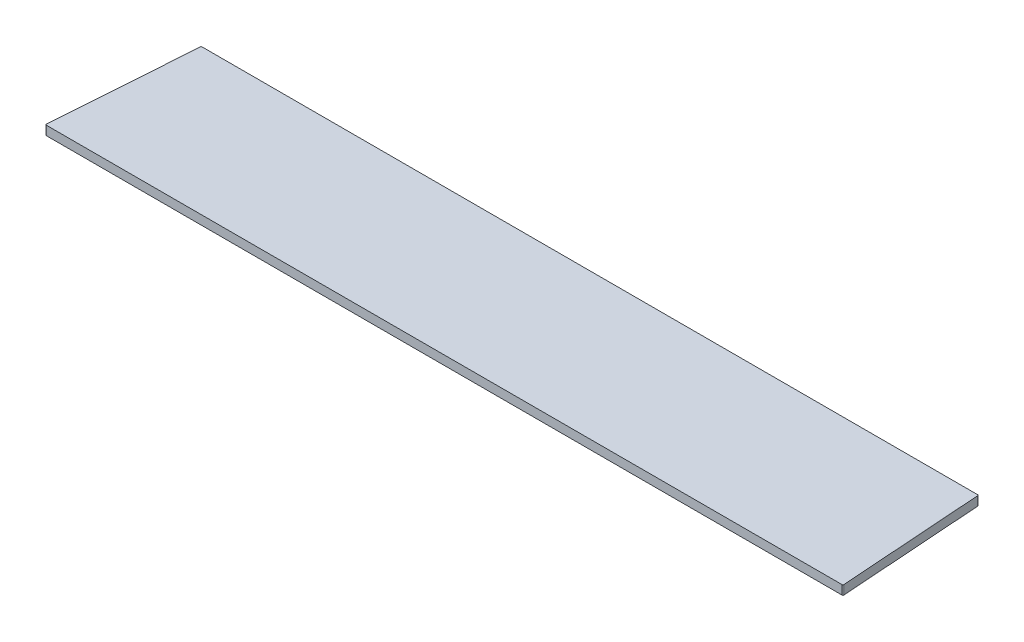
ISO-10303-21;
HEADER;
FILE_DESCRIPTION(('STEP AP214'),'2;1');
FILE_NAME('part.step','',(''),(''),'','','');
FILE_SCHEMA(('AUTOMOTIVE_DESIGN { 1 0 10303 214 1 1 1 1 }'));
ENDSEC;
DATA;
#1=APPLICATION_CONTEXT('core data for automotive mechanical design processes');
#2=APPLICATION_PROTOCOL_DEFINITION('international standard','automotive_design',2000,#1);
#3=PRODUCT_CONTEXT('',#1,'mechanical');
#4=PRODUCT('Part','Part','',(#3));
#5=PRODUCT_RELATED_PRODUCT_CATEGORY('part','',(#4));
#6=PRODUCT_DEFINITION_FORMATION('','',#4);
#7=PRODUCT_DEFINITION_CONTEXT('part definition',#1,'design');
#8=PRODUCT_DEFINITION('design','',#6,#7);
#9=PRODUCT_DEFINITION_SHAPE('','',#8);
#10=(LENGTH_UNIT() NAMED_UNIT(*) SI_UNIT(.MILLI.,.METRE.));
#11=(NAMED_UNIT(*) PLANE_ANGLE_UNIT() SI_UNIT($,.RADIAN.));
#12=(NAMED_UNIT(*) SI_UNIT($,.STERADIAN.) SOLID_ANGLE_UNIT());
#13=UNCERTAINTY_MEASURE_WITH_UNIT(LENGTH_MEASURE(1.E-05),#10,'distance_accuracy_value','');
#14=(GEOMETRIC_REPRESENTATION_CONTEXT(3) GLOBAL_UNCERTAINTY_ASSIGNED_CONTEXT((#13)) GLOBAL_UNIT_ASSIGNED_CONTEXT((#10,
#11,#12)) REPRESENTATION_CONTEXT('',''));
#15=CARTESIAN_POINT('',(0.,0.,0.));
#16=DIRECTION('',(0.,0.,1.));
#17=DIRECTION('',(1.,0.,0.));
#18=AXIS2_PLACEMENT_3D('',#15,#16,#17);
#19=CARTESIAN_POINT('',(-426.811710089038,-10.,-160.));
#20=DIRECTION('',(-0.997564050259824,0.,-0.069756473744129));
#21=DIRECTION('',(-0.069756473744129,0.,0.997564050259824));
#22=AXIS2_PLACEMENT_3D('',#19,#20,#21);
#23=PLANE('',#22);
#24=DIRECTION('',(-0.069756473744129,0.,0.997564050259824));
#25=VECTOR('',#24,1.);
#26=CARTESIAN_POINT('',(-426.811710089038,0.,-160.));
#27=LINE('',#26,#25);
#28=CARTESIAN_POINT('',(-426.87675905316,0.,-159.069756473744));
#29=VERTEX_POINT('',#28);
#30=CARTESIAN_POINT('',(-437.925195340235,0.,-1.0697564737441));
#31=VERTEX_POINT('',#30);
#32=EDGE_CURVE('E108',#29,#31,#27,.T.);
#33=ORIENTED_EDGE('',*,*,#32,.F.);
#34=DIRECTION('',(0.,1.,0.));
#35=VECTOR('',#34,1.);
#36=CARTESIAN_POINT('',(-426.87675905316,-10.,-159.069756473744));
#37=LINE('',#36,#35);
#38=CARTESIAN_POINT('',(-426.87675905316,-10.,-159.069756473744));
#39=VERTEX_POINT('',#38);
#40=EDGE_CURVE('E11',#29,#39,#37,.F.);
#41=ORIENTED_EDGE('',*,*,#40,.T.);
#42=DIRECTION('',(-0.069756473744129,0.,0.997564050259824));
#43=VECTOR('',#42,1.);
#44=CARTESIAN_POINT('',(-426.811710089038,-10.,-160.));
#45=LINE('',#44,#43);
#46=CARTESIAN_POINT('',(-437.925195340235,-10.,-1.0697564737441));
#47=VERTEX_POINT('',#46);
#48=EDGE_CURVE('E158',#39,#47,#45,.T.);
#49=ORIENTED_EDGE('',*,*,#48,.T.);
#50=DIRECTION('',(0.,1.,0.));
#51=VECTOR('',#50,1.);
#52=CARTESIAN_POINT('',(-437.925195340235,-10.,-1.06975647374413));
#53=LINE('',#52,#51);
#54=EDGE_CURVE('E45',#47,#31,#53,.T.);
#55=ORIENTED_EDGE('',*,*,#54,.T.);
#56=EDGE_LOOP('',(#33,#41,#49,#55));
#57=FACE_BOUND('',#56,.T.);
#58=ADVANCED_FACE('F37',(#57),#23,.T.);
#59=CARTESIAN_POINT('',(-426.811710089038,-10.,-160.));
#60=DIRECTION('',(0.,0.,-1.));
#61=DIRECTION('',(-1.,0.,0.));
#62=AXIS2_PLACEMENT_3D('',#59,#60,#61);
#63=PLANE('',#62);
#64=DIRECTION('',(-1.,0.,0.));
#65=VECTOR('',#64,1.);
#66=CARTESIAN_POINT('',(-426.811710089038,0.,-160.));
#67=LINE('',#66,#65);
#68=CARTESIAN_POINT('',(425.8791950029,0.,-160.));
#69=VERTEX_POINT('',#68);
#70=CARTESIAN_POINT('',(-425.8791950029,0.,-160.));
#71=VERTEX_POINT('',#70);
#72=EDGE_CURVE('E133',#69,#71,#67,.T.);
#73=ORIENTED_EDGE('',*,*,#72,.F.);
#74=DIRECTION('',(0.,1.,0.));
#75=VECTOR('',#74,1.);
#76=CARTESIAN_POINT('',(425.8791950029,-10.,-160.));
#77=LINE('',#76,#75);
#78=CARTESIAN_POINT('',(425.8791950029,-10.,-160.));
#79=VERTEX_POINT('',#78);
#80=EDGE_CURVE('E59',#69,#79,#77,.F.);
#81=ORIENTED_EDGE('',*,*,#80,.T.);
#82=DIRECTION('',(-1.,0.,0.));
#83=VECTOR('',#82,1.);
#84=CARTESIAN_POINT('',(-426.811710089038,-10.,-160.));
#85=LINE('',#84,#83);
#86=CARTESIAN_POINT('',(-425.8791950029,-10.,-160.));
#87=VERTEX_POINT('',#86);
#88=EDGE_CURVE('E127',#79,#87,#85,.T.);
#89=ORIENTED_EDGE('',*,*,#88,.T.);
#90=DIRECTION('',(0.,1.,0.));
#91=VECTOR('',#90,1.);
#92=CARTESIAN_POINT('',(-425.8791950029,-10.,-160.));
#93=LINE('',#92,#91);
#94=EDGE_CURVE('E152',#87,#71,#93,.T.);
#95=ORIENTED_EDGE('',*,*,#94,.T.);
#96=EDGE_LOOP('',(#73,#81,#89,#95));
#97=FACE_BOUND('',#96,.T.);
#98=ADVANCED_FACE('F190',(#97),#63,.T.);
#99=CARTESIAN_POINT('',(426.811710089038,-10.,-160.));
#100=DIRECTION('',(0.997564050259824,0.,-0.069756473744129));
#101=DIRECTION('',(-0.069756473744129,0.,-0.997564050259824));
#102=AXIS2_PLACEMENT_3D('',#99,#100,#101);
#103=PLANE('',#102);
#104=DIRECTION('',(-0.069756473744129,0.,-0.997564050259824));
#105=VECTOR('',#104,1.);
#106=CARTESIAN_POINT('',(426.811710089038,0.,-160.));
#107=LINE('',#106,#105);
#108=CARTESIAN_POINT('',(437.925195340235,0.,-1.0697564737441));
#109=VERTEX_POINT('',#108);
#110=CARTESIAN_POINT('',(426.87675905316,0.,-159.069756473744));
#111=VERTEX_POINT('',#110);
#112=EDGE_CURVE('E123',#109,#111,#107,.T.);
#113=ORIENTED_EDGE('',*,*,#112,.F.);
#114=DIRECTION('',(0.,1.,0.));
#115=VECTOR('',#114,1.);
#116=CARTESIAN_POINT('',(437.925195340235,-10.,-1.06975647374413));
#117=LINE('',#116,#115);
#118=CARTESIAN_POINT('',(437.925195340235,-10.,-1.0697564737441));
#119=VERTEX_POINT('',#118);
#120=EDGE_CURVE('E144',#109,#119,#117,.F.);
#121=ORIENTED_EDGE('',*,*,#120,.T.);
#122=DIRECTION('',(-0.069756473744129,0.,-0.997564050259824));
#123=VECTOR('',#122,1.);
#124=CARTESIAN_POINT('',(426.811710089038,-10.,-160.));
#125=LINE('',#124,#123);
#126=CARTESIAN_POINT('',(426.87675905316,-10.,-159.069756473744));
#127=VERTEX_POINT('',#126);
#128=EDGE_CURVE('E130',#119,#127,#125,.T.);
#129=ORIENTED_EDGE('',*,*,#128,.T.);
#130=DIRECTION('',(0.,1.,0.));
#131=VECTOR('',#130,1.);
#132=CARTESIAN_POINT('',(426.87675905316,-10.,-159.069756473744));
#133=LINE('',#132,#131);
#134=EDGE_CURVE('E141',#127,#111,#133,.T.);
#135=ORIENTED_EDGE('',*,*,#134,.T.);
#136=EDGE_LOOP('',(#113,#121,#129,#135));
#137=FACE_BOUND('',#136,.T.);
#138=ADVANCED_FACE('F170',(#137),#103,.T.);
#139=CARTESIAN_POINT('',(-438.,-10.,0.));
#140=DIRECTION('',(0.,0.,1.));
#141=DIRECTION('',(1.,0.,0.));
#142=AXIS2_PLACEMENT_3D('',#139,#140,#141);
#143=PLANE('',#142);
#144=DIRECTION('',(1.,0.,0.));
#145=VECTOR('',#144,1.);
#146=CARTESIAN_POINT('',(-438.,-10.,0.));
#147=LINE('',#146,#145);
#148=CARTESIAN_POINT('',(-436.927631289975,-10.,0.));
#149=VERTEX_POINT('',#148);
#150=CARTESIAN_POINT('',(436.927631289975,-10.,0.));
#151=VERTEX_POINT('',#150);
#152=EDGE_CURVE('E159',#149,#151,#147,.T.);
#153=ORIENTED_EDGE('',*,*,#152,.T.);
#154=DIRECTION('',(0.,1.,0.));
#155=VECTOR('',#154,1.);
#156=CARTESIAN_POINT('',(436.927631289975,-10.,0.));
#157=LINE('',#156,#155);
#158=CARTESIAN_POINT('',(436.927631289975,0.,0.));
#159=VERTEX_POINT('',#158);
#160=EDGE_CURVE('E114',#151,#159,#157,.T.);
#161=ORIENTED_EDGE('',*,*,#160,.T.);
#162=DIRECTION('',(1.,0.,0.));
#163=VECTOR('',#162,1.);
#164=CARTESIAN_POINT('',(-438.,0.,0.));
#165=LINE('',#164,#163);
#166=CARTESIAN_POINT('',(-436.927631289975,0.,0.));
#167=VERTEX_POINT('',#166);
#168=EDGE_CURVE('E106',#167,#159,#165,.T.);
#169=ORIENTED_EDGE('',*,*,#168,.F.);
#170=DIRECTION('',(0.,1.,0.));
#171=VECTOR('',#170,1.);
#172=CARTESIAN_POINT('',(-436.927631289975,-10.,0.));
#173=LINE('',#172,#171);
#174=EDGE_CURVE('E120',#167,#149,#173,.F.);
#175=ORIENTED_EDGE('',*,*,#174,.T.);
#176=EDGE_LOOP('',(#153,#161,#169,#175));
#177=FACE_BOUND('',#176,.T.);
#178=ADVANCED_FACE('F119',(#177),#143,.T.);
#179=CARTESIAN_POINT('',(0.,-10.,0.));
#180=DIRECTION('',(0.,1.,0.));
#181=DIRECTION('',(0.,0.,1.));
#182=AXIS2_PLACEMENT_3D('',#179,#180,#181);
#183=PLANE('',#182);
#184=ORIENTED_EDGE('',*,*,#128,.F.);
#185=CARTESIAN_POINT('',(436.927631289975,-10.,-1.));
#186=DIRECTION('',(0.,1.,0.));
#187=DIRECTION('',(0.,0.,1.));
#188=AXIS2_PLACEMENT_3D('',#185,#186,#187);
#189=CIRCLE('',#188,1.);
#190=EDGE_CURVE('E150',#119,#151,#189,.F.);
#191=ORIENTED_EDGE('',*,*,#190,.T.);
#192=ORIENTED_EDGE('',*,*,#152,.F.);
#193=CARTESIAN_POINT('',(-436.927631289975,-10.,-1.));
#194=DIRECTION('',(0.,1.,0.));
#195=DIRECTION('',(0.,0.,1.));
#196=AXIS2_PLACEMENT_3D('',#193,#194,#195);
#197=CIRCLE('',#196,1.);
#198=EDGE_CURVE('E126',#149,#47,#197,.F.);
#199=ORIENTED_EDGE('',*,*,#198,.T.);
#200=ORIENTED_EDGE('',*,*,#48,.F.);
#201=CARTESIAN_POINT('',(-425.8791950029,-10.,-159.));
#202=DIRECTION('',(0.,1.,0.));
#203=DIRECTION('',(0.,0.,1.));
#204=AXIS2_PLACEMENT_3D('',#201,#202,#203);
#205=CIRCLE('',#204,1.);
#206=EDGE_CURVE('E52',#39,#87,#205,.F.);
#207=ORIENTED_EDGE('',*,*,#206,.T.);
#208=ORIENTED_EDGE('',*,*,#88,.F.);
#209=CARTESIAN_POINT('',(425.8791950029,-10.,-159.));
#210=DIRECTION('',(0.,1.,0.));
#211=DIRECTION('',(0.,0.,1.));
#212=AXIS2_PLACEMENT_3D('',#209,#210,#211);
#213=CIRCLE('',#212,1.);
#214=EDGE_CURVE('E148',#79,#127,#213,.F.);
#215=ORIENTED_EDGE('',*,*,#214,.T.);
#216=EDGE_LOOP('',(#184,#191,#192,#199,#200,#207,#208,#215));
#217=FACE_BOUND('',#216,.T.);
#218=ADVANCED_FACE('F176',(#217),#183,.F.);
#219=CARTESIAN_POINT('',(0.,0.,0.));
#220=DIRECTION('',(0.,1.,0.));
#221=DIRECTION('',(0.,0.,1.));
#222=AXIS2_PLACEMENT_3D('',#219,#220,#221);
#223=PLANE('',#222);
#224=ORIENTED_EDGE('',*,*,#168,.T.);
#225=CARTESIAN_POINT('',(436.927631289975,0.,-1.));
#226=DIRECTION('',(0.,1.,0.));
#227=DIRECTION('',(0.,0.,1.));
#228=AXIS2_PLACEMENT_3D('',#225,#226,#227);
#229=CIRCLE('',#228,1.);
#230=EDGE_CURVE('E139',#159,#109,#229,.T.);
#231=ORIENTED_EDGE('',*,*,#230,.T.);
#232=ORIENTED_EDGE('',*,*,#112,.T.);
#233=CARTESIAN_POINT('',(425.8791950029,0.,-159.));
#234=DIRECTION('',(0.,1.,0.));
#235=DIRECTION('',(0.,0.,1.));
#236=AXIS2_PLACEMENT_3D('',#233,#234,#235);
#237=CIRCLE('',#236,1.);
#238=EDGE_CURVE('E137',#111,#69,#237,.T.);
#239=ORIENTED_EDGE('',*,*,#238,.T.);
#240=ORIENTED_EDGE('',*,*,#72,.T.);
#241=CARTESIAN_POINT('',(-425.8791950029,0.,-159.));
#242=DIRECTION('',(0.,1.,0.));
#243=DIRECTION('',(0.,0.,1.));
#244=AXIS2_PLACEMENT_3D('',#241,#242,#243);
#245=CIRCLE('',#244,1.);
#246=EDGE_CURVE('E113',#71,#29,#245,.T.);
#247=ORIENTED_EDGE('',*,*,#246,.T.);
#248=ORIENTED_EDGE('',*,*,#32,.T.);
#249=CARTESIAN_POINT('',(-436.927631289975,0.,-1.));
#250=DIRECTION('',(0.,1.,0.));
#251=DIRECTION('',(0.,0.,1.));
#252=AXIS2_PLACEMENT_3D('',#249,#250,#251);
#253=CIRCLE('',#252,1.);
#254=EDGE_CURVE('E103',#31,#167,#253,.T.);
#255=ORIENTED_EDGE('',*,*,#254,.T.);
#256=EDGE_LOOP('',(#224,#231,#232,#239,#240,#247,#248,#255));
#257=FACE_BOUND('',#256,.T.);
#258=ADVANCED_FACE('F105',(#257),#223,.T.);
#259=CARTESIAN_POINT('',(436.927631289975,-10.,-1.));
#260=DIRECTION('',(0.,1.,0.));
#261=DIRECTION('',(0.,0.,1.));
#262=AXIS2_PLACEMENT_3D('',#259,#260,#261);
#263=CYLINDRICAL_SURFACE('',#262,1.);
#264=ORIENTED_EDGE('',*,*,#190,.F.);
#265=ORIENTED_EDGE('',*,*,#120,.F.);
#266=ORIENTED_EDGE('',*,*,#230,.F.);
#267=ORIENTED_EDGE('',*,*,#160,.F.);
#268=EDGE_LOOP('',(#264,#265,#266,#267));
#269=FACE_BOUND('',#268,.T.);
#270=ADVANCED_FACE('F175',(#269),#263,.T.);
#271=CARTESIAN_POINT('',(425.8791950029,-10.,-159.));
#272=DIRECTION('',(0.,1.,0.));
#273=DIRECTION('',(0.,0.,1.));
#274=AXIS2_PLACEMENT_3D('',#271,#272,#273);
#275=CYLINDRICAL_SURFACE('',#274,1.);
#276=ORIENTED_EDGE('',*,*,#214,.F.);
#277=ORIENTED_EDGE('',*,*,#80,.F.);
#278=ORIENTED_EDGE('',*,*,#238,.F.);
#279=ORIENTED_EDGE('',*,*,#134,.F.);
#280=EDGE_LOOP('',(#276,#277,#278,#279));
#281=FACE_BOUND('',#280,.T.);
#282=ADVANCED_FACE('F179',(#281),#275,.T.);
#283=CARTESIAN_POINT('',(-425.8791950029,-10.,-159.));
#284=DIRECTION('',(0.,1.,0.));
#285=DIRECTION('',(0.,0.,1.));
#286=AXIS2_PLACEMENT_3D('',#283,#284,#285);
#287=CYLINDRICAL_SURFACE('',#286,1.);
#288=ORIENTED_EDGE('',*,*,#206,.F.);
#289=ORIENTED_EDGE('',*,*,#40,.F.);
#290=ORIENTED_EDGE('',*,*,#246,.F.);
#291=ORIENTED_EDGE('',*,*,#94,.F.);
#292=EDGE_LOOP('',(#288,#289,#290,#291));
#293=FACE_BOUND('',#292,.T.);
#294=ADVANCED_FACE('F181',(#293),#287,.T.);
#295=CARTESIAN_POINT('',(-436.927631289975,-10.,-1.));
#296=DIRECTION('',(0.,1.,0.));
#297=DIRECTION('',(0.,0.,1.));
#298=AXIS2_PLACEMENT_3D('',#295,#296,#297);
#299=CYLINDRICAL_SURFACE('',#298,1.);
#300=ORIENTED_EDGE('',*,*,#198,.F.);
#301=ORIENTED_EDGE('',*,*,#174,.F.);
#302=ORIENTED_EDGE('',*,*,#254,.F.);
#303=ORIENTED_EDGE('',*,*,#54,.F.);
#304=EDGE_LOOP('',(#300,#301,#302,#303));
#305=FACE_BOUND('',#304,.T.);
#306=ADVANCED_FACE('F39',(#305),#299,.T.);
#307=CLOSED_SHELL('',(#58,#98,#138,#178,#218,#258,#270,#282,#294,#306));
#308=MANIFOLD_SOLID_BREP('B2',#307);
#309=ADVANCED_BREP_SHAPE_REPRESENTATION('',(#18,#308),#14);
#310=SHAPE_DEFINITION_REPRESENTATION(#9,#309);
ENDSEC;
END-ISO-10303-21;
